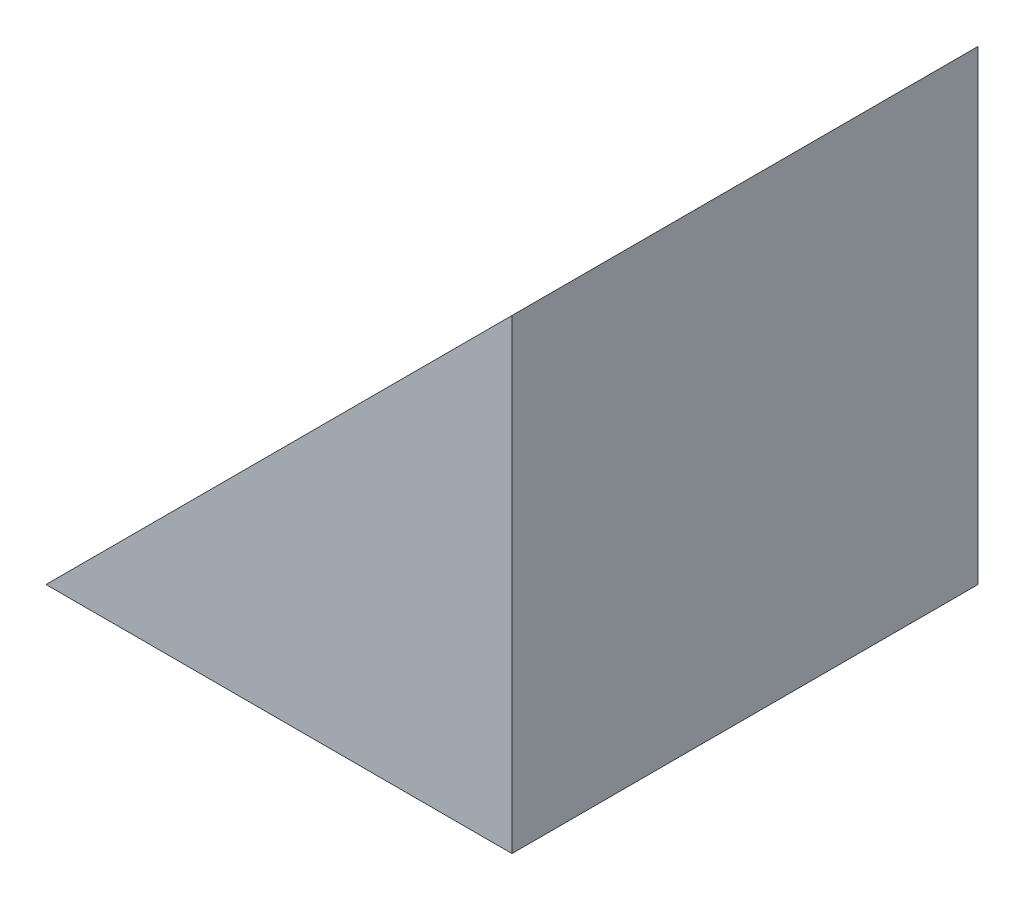
ISO-10303-21;
HEADER;
FILE_DESCRIPTION(('STEP AP214'),'2;1');
FILE_NAME('part.step','',(''),(''),'','','');
FILE_SCHEMA(('AUTOMOTIVE_DESIGN { 1 0 10303 214 1 1 1 1 }'));
ENDSEC;
DATA;
#1=APPLICATION_CONTEXT('core data for automotive mechanical design processes');
#2=APPLICATION_PROTOCOL_DEFINITION('international standard','automotive_design',2000,#1);
#3=PRODUCT_CONTEXT('',#1,'mechanical');
#4=PRODUCT('Part','Part','',(#3));
#5=PRODUCT_RELATED_PRODUCT_CATEGORY('part','',(#4));
#6=PRODUCT_DEFINITION_FORMATION('','',#4);
#7=PRODUCT_DEFINITION_CONTEXT('part definition',#1,'design');
#8=PRODUCT_DEFINITION('design','',#6,#7);
#9=PRODUCT_DEFINITION_SHAPE('','',#8);
#10=(LENGTH_UNIT() NAMED_UNIT(*) SI_UNIT(.MILLI.,.METRE.));
#11=(NAMED_UNIT(*) PLANE_ANGLE_UNIT() SI_UNIT($,.RADIAN.));
#12=(NAMED_UNIT(*) SI_UNIT($,.STERADIAN.) SOLID_ANGLE_UNIT());
#13=UNCERTAINTY_MEASURE_WITH_UNIT(LENGTH_MEASURE(1.E-05),#10,'distance_accuracy_value','');
#14=(GEOMETRIC_REPRESENTATION_CONTEXT(3) GLOBAL_UNCERTAINTY_ASSIGNED_CONTEXT((#13)) GLOBAL_UNIT_ASSIGNED_CONTEXT((#10,
#11,#12)) REPRESENTATION_CONTEXT('',''));
#15=CARTESIAN_POINT('',(0.,0.,0.));
#16=DIRECTION('',(0.,0.,1.));
#17=DIRECTION('',(1.,0.,0.));
#18=AXIS2_PLACEMENT_3D('',#15,#16,#17);
#19=CARTESIAN_POINT('',(69.8856254843623,53.1116280961224,20.));
#20=DIRECTION('',(0.,-1.,0.));
#21=DIRECTION('',(0.,0.,-1.));
#22=AXIS2_PLACEMENT_3D('',#19,#20,#21);
#23=PLANE('',#22);
#24=DIRECTION('',(-1.,0.,0.));
#25=VECTOR('',#24,1.);
#26=CARTESIAN_POINT('',(69.8856254843623,53.1116280961224,0.));
#27=LINE('',#26,#25);
#28=CARTESIAN_POINT('',(69.8856254843623,53.1116280961224,0.));
#29=VERTEX_POINT('',#28);
#30=CARTESIAN_POINT('',(49.8856254843623,53.1116280961224,0.));
#31=VERTEX_POINT('',#30);
#32=EDGE_CURVE('E97',#29,#31,#27,.T.);
#33=ORIENTED_EDGE('',*,*,#32,.F.);
#34=DIRECTION('',(0.,0.,-1.));
#35=VECTOR('',#34,1.);
#36=CARTESIAN_POINT('',(69.8856254843623,53.1116280961224,20.));
#37=LINE('',#36,#35);
#38=CARTESIAN_POINT('',(69.8856254843623,53.1116280961224,20.));
#39=VERTEX_POINT('',#38);
#40=EDGE_CURVE('E11',#39,#29,#37,.T.);
#41=ORIENTED_EDGE('',*,*,#40,.F.);
#42=DIRECTION('',(-1.,0.,0.));
#43=VECTOR('',#42,1.);
#44=CARTESIAN_POINT('',(69.8856254843623,53.1116280961224,20.));
#45=LINE('',#44,#43);
#46=CARTESIAN_POINT('',(49.8856254843623,53.1116280961224,20.));
#47=VERTEX_POINT('',#46);
#48=EDGE_CURVE('E86',#39,#47,#45,.T.);
#49=ORIENTED_EDGE('',*,*,#48,.T.);
#50=DIRECTION('',(0.,0.,-1.));
#51=VECTOR('',#50,1.);
#52=CARTESIAN_POINT('',(49.8856254843623,53.1116280961224,20.));
#53=LINE('',#52,#51);
#54=EDGE_CURVE('E42',#47,#31,#53,.T.);
#55=ORIENTED_EDGE('',*,*,#54,.T.);
#56=EDGE_LOOP('',(#33,#41,#49,#55));
#57=FACE_BOUND('',#56,.T.);
#58=ADVANCED_FACE('F39',(#57),#23,.T.);
#59=CARTESIAN_POINT('',(69.8856254843623,53.1116280961224,20.));
#60=DIRECTION('',(-1.,0.,0.));
#61=DIRECTION('',(0.,0.,1.));
#62=AXIS2_PLACEMENT_3D('',#59,#60,#61);
#63=PLANE('',#62);
#64=DIRECTION('',(0.,1.,0.));
#65=VECTOR('',#64,1.);
#66=CARTESIAN_POINT('',(69.8856254843623,53.1116280961224,0.));
#67=LINE('',#66,#65);
#68=CARTESIAN_POINT('',(69.8856254843623,73.1116280961224,0.));
#69=VERTEX_POINT('',#68);
#70=EDGE_CURVE('E90',#29,#69,#67,.T.);
#71=ORIENTED_EDGE('',*,*,#70,.T.);
#72=DIRECTION('',(0.,0.,-1.));
#73=VECTOR('',#72,1.);
#74=CARTESIAN_POINT('',(69.8856254843623,73.1116280961224,20.));
#75=LINE('',#74,#73);
#76=CARTESIAN_POINT('',(69.8856254843623,73.1116280961224,20.));
#77=VERTEX_POINT('',#76);
#78=EDGE_CURVE('E49',#77,#69,#75,.T.);
#79=ORIENTED_EDGE('',*,*,#78,.F.);
#80=DIRECTION('',(0.,1.,0.));
#81=VECTOR('',#80,1.);
#82=CARTESIAN_POINT('',(69.8856254843623,53.1116280961224,20.));
#83=LINE('',#82,#81);
#84=EDGE_CURVE('E82',#39,#77,#83,.T.);
#85=ORIENTED_EDGE('',*,*,#84,.F.);
#86=ORIENTED_EDGE('',*,*,#40,.T.);
#87=EDGE_LOOP('',(#71,#79,#85,#86));
#88=FACE_BOUND('',#87,.T.);
#89=ADVANCED_FACE('F104',(#88),#63,.F.);
#90=CARTESIAN_POINT('',(49.8856254843623,53.1116280961224,20.));
#91=DIRECTION('',(-0.707106781186548,0.707106781186548,0.));
#92=DIRECTION('',(-0.707106781186548,-0.707106781186548,0.));
#93=AXIS2_PLACEMENT_3D('',#90,#91,#92);
#94=PLANE('',#93);
#95=DIRECTION('',(0.707106781186548,0.707106781186548,0.));
#96=VECTOR('',#95,1.);
#97=CARTESIAN_POINT('',(49.8856254843623,53.1116280961224,0.));
#98=LINE('',#97,#96);
#99=EDGE_CURVE('E79',#31,#69,#98,.T.);
#100=ORIENTED_EDGE('',*,*,#99,.F.);
#101=ORIENTED_EDGE('',*,*,#54,.F.);
#102=DIRECTION('',(0.707106781186548,0.707106781186548,0.));
#103=VECTOR('',#102,1.);
#104=CARTESIAN_POINT('',(49.8856254843623,53.1116280961224,20.));
#105=LINE('',#104,#103);
#106=EDGE_CURVE('E77',#47,#77,#105,.T.);
#107=ORIENTED_EDGE('',*,*,#106,.T.);
#108=ORIENTED_EDGE('',*,*,#78,.T.);
#109=EDGE_LOOP('',(#100,#101,#107,#108));
#110=FACE_BOUND('',#109,.T.);
#111=ADVANCED_FACE('F76',(#110),#94,.T.);
#112=CARTESIAN_POINT('',(0.,0.,20.));
#113=DIRECTION('',(0.,0.,-1.));
#114=DIRECTION('',(-1.,0.,0.));
#115=AXIS2_PLACEMENT_3D('',#112,#113,#114);
#116=PLANE('',#115);
#117=ORIENTED_EDGE('',*,*,#48,.F.);
#118=ORIENTED_EDGE('',*,*,#84,.T.);
#119=ORIENTED_EDGE('',*,*,#106,.F.);
#120=EDGE_LOOP('',(#117,#118,#119));
#121=FACE_BOUND('',#120,.T.);
#122=ADVANCED_FACE('F85',(#121),#116,.F.);
#123=CARTESIAN_POINT('',(0.,0.,0.));
#124=DIRECTION('',(0.,0.,-1.));
#125=DIRECTION('',(-1.,0.,0.));
#126=AXIS2_PLACEMENT_3D('',#123,#124,#125);
#127=PLANE('',#126);
#128=ORIENTED_EDGE('',*,*,#32,.T.);
#129=ORIENTED_EDGE('',*,*,#99,.T.);
#130=ORIENTED_EDGE('',*,*,#70,.F.);
#131=EDGE_LOOP('',(#128,#129,#130));
#132=FACE_BOUND('',#131,.T.);
#133=ADVANCED_FACE('F103',(#132),#127,.T.);
#134=CLOSED_SHELL('',(#58,#89,#111,#122,#133));
#135=MANIFOLD_SOLID_BREP('B2',#134);
#136=ADVANCED_BREP_SHAPE_REPRESENTATION('',(#18,#135),#14);
#137=SHAPE_DEFINITION_REPRESENTATION(#9,#136);
ENDSEC;
END-ISO-10303-21;
